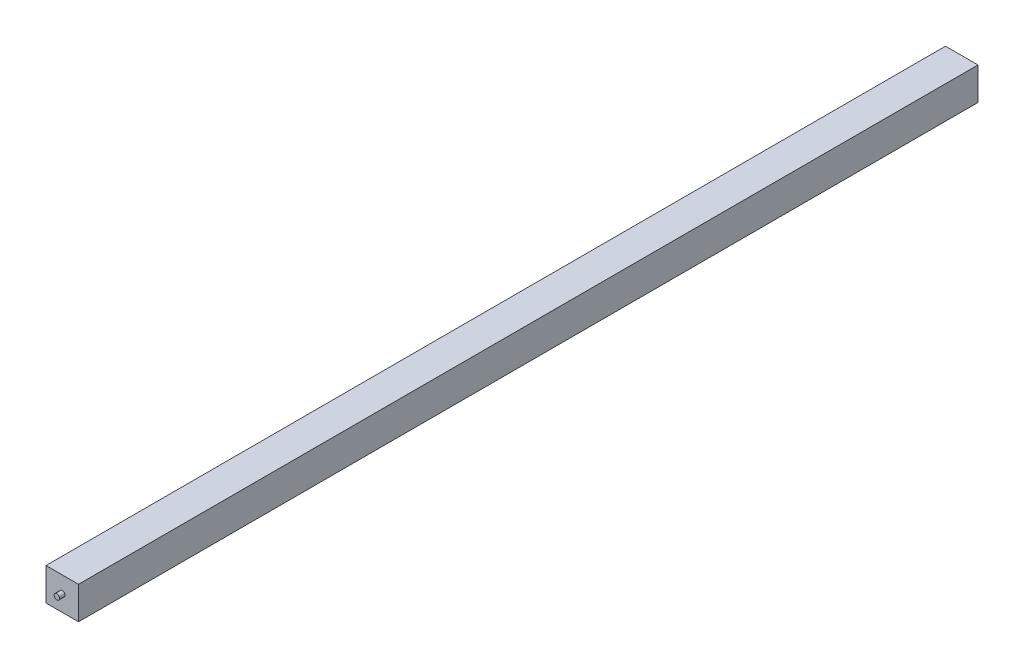
ISO-10303-21;
HEADER;
FILE_DESCRIPTION(('STEP AP214'),'2;1');
FILE_NAME('part.step','',(''),(''),'','','');
FILE_SCHEMA(('AUTOMOTIVE_DESIGN { 1 0 10303 214 1 1 1 1 }'));
ENDSEC;
DATA;
#1=APPLICATION_CONTEXT('core data for automotive mechanical design processes');
#2=APPLICATION_PROTOCOL_DEFINITION('international standard','automotive_design',2000,#1);
#3=PRODUCT_CONTEXT('',#1,'mechanical');
#4=PRODUCT('Part','Part','',(#3));
#5=PRODUCT_RELATED_PRODUCT_CATEGORY('part','',(#4));
#6=PRODUCT_DEFINITION_FORMATION('','',#4);
#7=PRODUCT_DEFINITION_CONTEXT('part definition',#1,'design');
#8=PRODUCT_DEFINITION('design','',#6,#7);
#9=PRODUCT_DEFINITION_SHAPE('','',#8);
#10=(LENGTH_UNIT() NAMED_UNIT(*) SI_UNIT(.MILLI.,.METRE.));
#11=(NAMED_UNIT(*) PLANE_ANGLE_UNIT() SI_UNIT($,.RADIAN.));
#12=(NAMED_UNIT(*) SI_UNIT($,.STERADIAN.) SOLID_ANGLE_UNIT());
#13=UNCERTAINTY_MEASURE_WITH_UNIT(LENGTH_MEASURE(1.E-05),#10,'distance_accuracy_value','');
#14=(GEOMETRIC_REPRESENTATION_CONTEXT(3) GLOBAL_UNCERTAINTY_ASSIGNED_CONTEXT((#13)) GLOBAL_UNIT_ASSIGNED_CONTEXT((#10,
#11,#12)) REPRESENTATION_CONTEXT('',''));
#15=CARTESIAN_POINT('',(0.,0.,0.));
#16=DIRECTION('',(0.,0.,1.));
#17=DIRECTION('',(1.,0.,0.));
#18=AXIS2_PLACEMENT_3D('',#15,#16,#17);
#19=CARTESIAN_POINT('',(15.,29.9999999999999,0.));
#20=DIRECTION('',(0.,0.,-1.));
#21=DIRECTION('',(-1.,0.,0.));
#22=AXIS2_PLACEMENT_3D('',#19,#20,#21);
#23=PLANE('',#22);
#24=DIRECTION('',(0.,-1.,0.));
#25=VECTOR('',#24,1.);
#26=CARTESIAN_POINT('',(-15.,29.9999999999999,0.));
#27=LINE('',#26,#25);
#28=CARTESIAN_POINT('',(-15.,29.9999999999999,0.));
#29=VERTEX_POINT('',#28);
#30=CARTESIAN_POINT('',(-15.,0.,0.));
#31=VERTEX_POINT('',#30);
#32=EDGE_CURVE('E102',#29,#31,#27,.T.);
#33=ORIENTED_EDGE('',*,*,#32,.T.);
#34=DIRECTION('',(-1.,0.,0.));
#35=VECTOR('',#34,1.);
#36=CARTESIAN_POINT('',(15.,0.,0.));
#37=LINE('',#36,#35);
#38=CARTESIAN_POINT('',(15.,0.,0.));
#39=VERTEX_POINT('',#38);
#40=EDGE_CURVE('E92',#39,#31,#37,.T.);
#41=ORIENTED_EDGE('',*,*,#40,.F.);
#42=DIRECTION('',(0.,-1.,0.));
#43=VECTOR('',#42,1.);
#44=CARTESIAN_POINT('',(15.,29.9999999999999,0.));
#45=LINE('',#44,#43);
#46=CARTESIAN_POINT('',(15.,29.9999999999999,0.));
#47=VERTEX_POINT('',#46);
#48=EDGE_CURVE('E86',#47,#39,#45,.T.);
#49=ORIENTED_EDGE('',*,*,#48,.F.);
#50=DIRECTION('',(-1.,0.,0.));
#51=VECTOR('',#50,1.);
#52=CARTESIAN_POINT('',(15.,29.9999999999999,0.));
#53=LINE('',#52,#51);
#54=EDGE_CURVE('E98',#47,#29,#53,.T.);
#55=ORIENTED_EDGE('',*,*,#54,.T.);
#56=EDGE_LOOP('',(#33,#41,#49,#55));
#57=FACE_BOUND('',#56,.T.);
#58=CARTESIAN_POINT('',(0.,14.9999999999999,0.));
#59=DIRECTION('',(0.,0.,-1.));
#60=DIRECTION('',(-1.,0.,0.));
#61=AXIS2_PLACEMENT_3D('',#58,#59,#60);
#62=CIRCLE('',#61,2.5);
#63=CARTESIAN_POINT('',(-2.5,14.9999999999999,0.));
#64=VERTEX_POINT('',#63);
#65=EDGE_CURVE('E11',#64,#64,#62,.F.);
#66=ORIENTED_EDGE('',*,*,#65,.F.);
#67=EDGE_LOOP('',(#66));
#68=FACE_BOUND('',#67,.T.);
#69=ADVANCED_FACE('F34',(#57,#68),#23,.F.);
#70=CARTESIAN_POINT('',(15.,0.,-830.));
#71=DIRECTION('',(0.,0.,1.));
#72=DIRECTION('',(1.,0.,0.));
#73=AXIS2_PLACEMENT_3D('',#70,#71,#72);
#74=PLANE('',#73);
#75=DIRECTION('',(0.,1.,0.));
#76=VECTOR('',#75,1.);
#77=CARTESIAN_POINT('',(-15.,0.,-830.));
#78=LINE('',#77,#76);
#79=CARTESIAN_POINT('',(-15.,0.,-830.));
#80=VERTEX_POINT('',#79);
#81=CARTESIAN_POINT('',(-15.,30.,-830.));
#82=VERTEX_POINT('',#81);
#83=EDGE_CURVE('E67',#80,#82,#78,.T.);
#84=ORIENTED_EDGE('',*,*,#83,.T.);
#85=DIRECTION('',(-1.,0.,0.));
#86=VECTOR('',#85,1.);
#87=CARTESIAN_POINT('',(15.,30.,-830.));
#88=LINE('',#87,#86);
#89=CARTESIAN_POINT('',(15.,30.,-830.));
#90=VERTEX_POINT('',#89);
#91=EDGE_CURVE('E93',#90,#82,#88,.T.);
#92=ORIENTED_EDGE('',*,*,#91,.F.);
#93=DIRECTION('',(0.,1.,0.));
#94=VECTOR('',#93,1.);
#95=CARTESIAN_POINT('',(15.,0.,-830.));
#96=LINE('',#95,#94);
#97=CARTESIAN_POINT('',(15.,0.,-830.));
#98=VERTEX_POINT('',#97);
#99=EDGE_CURVE('E84',#98,#90,#96,.T.);
#100=ORIENTED_EDGE('',*,*,#99,.F.);
#101=DIRECTION('',(-1.,0.,0.));
#102=VECTOR('',#101,1.);
#103=CARTESIAN_POINT('',(15.,0.,-830.));
#104=LINE('',#103,#102);
#105=EDGE_CURVE('E89',#98,#80,#104,.T.);
#106=ORIENTED_EDGE('',*,*,#105,.T.);
#107=EDGE_LOOP('',(#84,#92,#100,#106));
#108=FACE_BOUND('',#107,.T.);
#109=CARTESIAN_POINT('',(0.,15.,-830.));
#110=DIRECTION('',(0.,0.,1.));
#111=DIRECTION('',(1.,0.,0.));
#112=AXIS2_PLACEMENT_3D('',#109,#110,#111);
#113=CIRCLE('',#112,2.5);
#114=CARTESIAN_POINT('',(2.5,15.,-830.));
#115=VERTEX_POINT('',#114);
#116=EDGE_CURVE('E42',#115,#115,#113,.F.);
#117=ORIENTED_EDGE('',*,*,#116,.F.);
#118=EDGE_LOOP('',(#117));
#119=FACE_BOUND('',#118,.T.);
#120=ADVANCED_FACE('F95',(#108,#119),#74,.F.);
#121=CARTESIAN_POINT('',(15.,0.,0.));
#122=DIRECTION('',(0.,1.,0.));
#123=DIRECTION('',(0.,0.,1.));
#124=AXIS2_PLACEMENT_3D('',#121,#122,#123);
#125=PLANE('',#124);
#126=DIRECTION('',(0.,0.,-1.));
#127=VECTOR('',#126,1.);
#128=CARTESIAN_POINT('',(-15.,0.,0.));
#129=LINE('',#128,#127);
#130=EDGE_CURVE('E91',#31,#80,#129,.T.);
#131=ORIENTED_EDGE('',*,*,#130,.T.);
#132=ORIENTED_EDGE('',*,*,#105,.F.);
#133=DIRECTION('',(0.,0.,-1.));
#134=VECTOR('',#133,1.);
#135=CARTESIAN_POINT('',(15.,0.,0.));
#136=LINE('',#135,#134);
#137=EDGE_CURVE('E81',#39,#98,#136,.T.);
#138=ORIENTED_EDGE('',*,*,#137,.F.);
#139=ORIENTED_EDGE('',*,*,#40,.T.);
#140=EDGE_LOOP('',(#131,#132,#138,#139));
#141=FACE_BOUND('',#140,.T.);
#142=ADVANCED_FACE('F90',(#141),#125,.F.);
#143=CARTESIAN_POINT('',(15.,30.,-830.));
#144=DIRECTION('',(0.,-1.,0.));
#145=DIRECTION('',(0.,0.,-1.));
#146=AXIS2_PLACEMENT_3D('',#143,#144,#145);
#147=PLANE('',#146);
#148=DIRECTION('',(0.,0.,1.));
#149=VECTOR('',#148,1.);
#150=CARTESIAN_POINT('',(-15.,30.,-830.));
#151=LINE('',#150,#149);
#152=EDGE_CURVE('E73',#82,#29,#151,.T.);
#153=ORIENTED_EDGE('',*,*,#152,.T.);
#154=ORIENTED_EDGE('',*,*,#54,.F.);
#155=DIRECTION('',(0.,0.,1.));
#156=VECTOR('',#155,1.);
#157=CARTESIAN_POINT('',(15.,30.,-830.));
#158=LINE('',#157,#156);
#159=EDGE_CURVE('E50',#90,#47,#158,.T.);
#160=ORIENTED_EDGE('',*,*,#159,.F.);
#161=ORIENTED_EDGE('',*,*,#91,.T.);
#162=EDGE_LOOP('',(#153,#154,#160,#161));
#163=FACE_BOUND('',#162,.T.);
#164=ADVANCED_FACE('F121',(#163),#147,.F.);
#165=CARTESIAN_POINT('',(15.,0.,0.));
#166=DIRECTION('',(1.,0.,0.));
#167=DIRECTION('',(0.,0.,-1.));
#168=AXIS2_PLACEMENT_3D('',#165,#166,#167);
#169=PLANE('',#168);
#170=ORIENTED_EDGE('',*,*,#48,.T.);
#171=ORIENTED_EDGE('',*,*,#137,.T.);
#172=ORIENTED_EDGE('',*,*,#99,.T.);
#173=ORIENTED_EDGE('',*,*,#159,.T.);
#174=EDGE_LOOP('',(#170,#171,#172,#173));
#175=FACE_BOUND('',#174,.T.);
#176=ADVANCED_FACE('F82',(#175),#169,.T.);
#177=CARTESIAN_POINT('',(-15.,0.,0.));
#178=DIRECTION('',(1.,0.,0.));
#179=DIRECTION('',(0.,0.,-1.));
#180=AXIS2_PLACEMENT_3D('',#177,#178,#179);
#181=PLANE('',#180);
#182=ORIENTED_EDGE('',*,*,#32,.F.);
#183=ORIENTED_EDGE('',*,*,#152,.F.);
#184=ORIENTED_EDGE('',*,*,#83,.F.);
#185=ORIENTED_EDGE('',*,*,#130,.F.);
#186=EDGE_LOOP('',(#182,#183,#184,#185));
#187=FACE_BOUND('',#186,.T.);
#188=ADVANCED_FACE('F126',(#187),#181,.F.);
#189=CARTESIAN_POINT('',(0.,15.,-835.));
#190=DIRECTION('',(0.,0.,1.));
#191=DIRECTION('',(1.,0.,0.));
#192=AXIS2_PLACEMENT_3D('',#189,#190,#191);
#193=CYLINDRICAL_SURFACE('',#192,2.5);
#194=CARTESIAN_POINT('',(0.,15.,-835.));
#195=DIRECTION('',(0.,0.,-1.));
#196=DIRECTION('',(-1.,0.,0.));
#197=AXIS2_PLACEMENT_3D('',#194,#195,#196);
#198=CIRCLE('',#197,2.5);
#199=CARTESIAN_POINT('',(-2.5,15.,-835.));
#200=VERTEX_POINT('',#199);
#201=EDGE_CURVE('E105',#200,#200,#198,.T.);
#202=ORIENTED_EDGE('',*,*,#201,.F.);
#203=EDGE_LOOP('',(#202));
#204=FACE_BOUND('',#203,.T.);
#205=ORIENTED_EDGE('',*,*,#116,.T.);
#206=EDGE_LOOP('',(#205));
#207=FACE_BOUND('',#206,.T.);
#208=ADVANCED_FACE('F114',(#204,#207),#193,.T.);
#209=CARTESIAN_POINT('',(0.,15.,-835.));
#210=DIRECTION('',(0.,0.,-1.));
#211=DIRECTION('',(-1.,0.,0.));
#212=AXIS2_PLACEMENT_3D('',#209,#210,#211);
#213=PLANE('',#212);
#214=ORIENTED_EDGE('',*,*,#201,.T.);
#215=EDGE_LOOP('',(#214));
#216=FACE_BOUND('',#215,.T.);
#217=ADVANCED_FACE('F134',(#216),#213,.T.);
#218=CARTESIAN_POINT('',(0.,14.9999999999999,5.));
#219=DIRECTION('',(0.,0.,-1.));
#220=DIRECTION('',(-1.,0.,0.));
#221=AXIS2_PLACEMENT_3D('',#218,#219,#220);
#222=CYLINDRICAL_SURFACE('',#221,2.5);
#223=CARTESIAN_POINT('',(0.,14.9999999999999,5.));
#224=DIRECTION('',(0.,0.,1.));
#225=DIRECTION('',(1.,0.,0.));
#226=AXIS2_PLACEMENT_3D('',#223,#224,#225);
#227=CIRCLE('',#226,2.5);
#228=CARTESIAN_POINT('',(2.5,14.9999999999999,5.));
#229=VERTEX_POINT('',#228);
#230=EDGE_CURVE('E150',#229,#229,#227,.T.);
#231=ORIENTED_EDGE('',*,*,#230,.F.);
#232=EDGE_LOOP('',(#231));
#233=FACE_BOUND('',#232,.T.);
#234=ORIENTED_EDGE('',*,*,#65,.T.);
#235=EDGE_LOOP('',(#234));
#236=FACE_BOUND('',#235,.T.);
#237=ADVANCED_FACE('F138',(#233,#236),#222,.T.);
#238=CARTESIAN_POINT('',(0.,14.9999999999999,5.));
#239=DIRECTION('',(0.,0.,1.));
#240=DIRECTION('',(1.,0.,0.));
#241=AXIS2_PLACEMENT_3D('',#238,#239,#240);
#242=PLANE('',#241);
#243=ORIENTED_EDGE('',*,*,#230,.T.);
#244=EDGE_LOOP('',(#243));
#245=FACE_BOUND('',#244,.T.);
#246=ADVANCED_FACE('F142',(#245),#242,.T.);
#247=CLOSED_SHELL('',(#69,#120,#142,#164,#176,#188,#208,#217,#237,#246));
#248=MANIFOLD_SOLID_BREP('B2',#247);
#249=ADVANCED_BREP_SHAPE_REPRESENTATION('',(#18,#248),#14);
#250=SHAPE_DEFINITION_REPRESENTATION(#9,#249);
ENDSEC;
END-ISO-10303-21;
